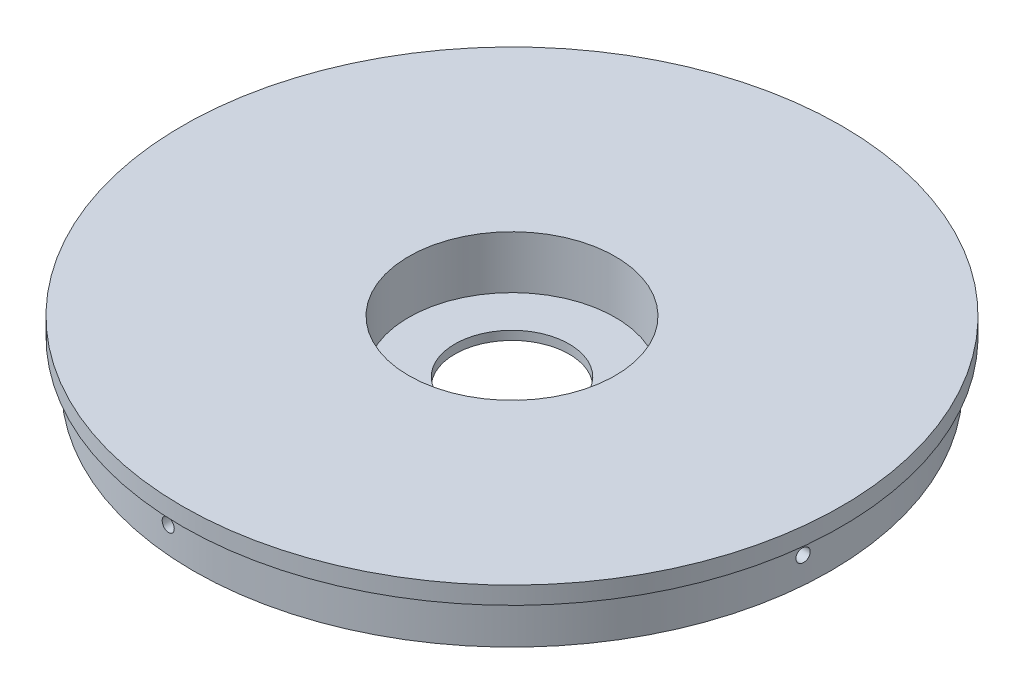
ISO-10303-21;
HEADER;
FILE_DESCRIPTION(('STEP AP214'),'2;1');
FILE_NAME('part.step','',(''),(''),'','','');
FILE_SCHEMA(('AUTOMOTIVE_DESIGN { 1 0 10303 214 1 1 1 1 }'));
ENDSEC;
DATA;
#1=APPLICATION_CONTEXT('core data for automotive mechanical design processes');
#2=APPLICATION_PROTOCOL_DEFINITION('international standard','automotive_design',2000,#1);
#3=PRODUCT_CONTEXT('',#1,'mechanical');
#4=PRODUCT('Part','Part','',(#3));
#5=PRODUCT_RELATED_PRODUCT_CATEGORY('part','',(#4));
#6=PRODUCT_DEFINITION_FORMATION('','',#4);
#7=PRODUCT_DEFINITION_CONTEXT('part definition',#1,'design');
#8=PRODUCT_DEFINITION('design','',#6,#7);
#9=PRODUCT_DEFINITION_SHAPE('','',#8);
#10=(LENGTH_UNIT() NAMED_UNIT(*) SI_UNIT(.MILLI.,.METRE.));
#11=(NAMED_UNIT(*) PLANE_ANGLE_UNIT() SI_UNIT($,.RADIAN.));
#12=(NAMED_UNIT(*) SI_UNIT($,.STERADIAN.) SOLID_ANGLE_UNIT());
#13=UNCERTAINTY_MEASURE_WITH_UNIT(LENGTH_MEASURE(1.E-05),#10,'distance_accuracy_value','');
#14=(GEOMETRIC_REPRESENTATION_CONTEXT(3) GLOBAL_UNCERTAINTY_ASSIGNED_CONTEXT((#13)) GLOBAL_UNIT_ASSIGNED_CONTEXT((#10,
#11,#12)) REPRESENTATION_CONTEXT('',''));
#15=CARTESIAN_POINT('',(0.,0.,0.));
#16=DIRECTION('',(0.,0.,1.));
#17=DIRECTION('',(1.,0.,0.));
#18=AXIS2_PLACEMENT_3D('',#15,#16,#17);
#19=CARTESIAN_POINT('',(0.,10.,0.));
#20=DIRECTION('',(0.,-1.,0.));
#21=DIRECTION('',(0.,0.,-1.));
#22=AXIS2_PLACEMENT_3D('',#19,#20,#21);
#23=CYLINDRICAL_SURFACE('',#22,72.5);
#24=CARTESIAN_POINT('',(4.50000000000025,6.,-72.3602100605022));
#25=CARTESIAN_POINT('',(4.50000374174907,5.91587615849677,-72.3602099601044));
#26=CARTESIAN_POINT('',(4.5071007640157,5.8316915099936,-72.3597695558079));
#27=CARTESIAN_POINT('',(4.53531119513864,5.66564258786703,-72.3580067745733));
#28=CARTESIAN_POINT('',(4.55644141002461,5.58378121930415,-72.356683340117));
#29=CARTESIAN_POINT('',(4.61210871373629,5.42480988251239,-72.3531562998758));
#30=CARTESIAN_POINT('',(4.64663901924744,5.34769753311128,-72.3509531394043));
#31=CARTESIAN_POINT('',(4.72810701787819,5.20039281741381,-72.345674798998));
#32=CARTESIAN_POINT('',(4.77504165429097,5.13019875213883,-72.342599833882));
#33=CARTESIAN_POINT('',(4.88001873422523,4.99863631069484,-72.3355941308026));
#34=CARTESIAN_POINT('',(4.93806970922897,4.93727477702333,-72.3316627352317));
#35=CARTESIAN_POINT('',(5.06359846691124,4.8251663026825,-72.322983348815));
#36=CARTESIAN_POINT('',(5.13107668555497,4.77441985318154,-72.3182353202015));
#37=CARTESIAN_POINT('',(5.27366744818788,4.68487970305881,-72.3079770325382));
#38=CARTESIAN_POINT('',(5.34879384343714,4.64610822081323,-72.3024653837766));
#39=CARTESIAN_POINT('',(5.50443909652356,4.58172199542251,-72.2907825040559));
#40=CARTESIAN_POINT('',(5.58495802008611,4.55610741266972,-72.2846112650571));
#41=CARTESIAN_POINT('',(5.74932872897224,4.51868730947415,-72.2717235802799));
#42=CARTESIAN_POINT('',(5.83318884277598,4.50691885985065,-72.2650057221317));
#43=CARTESIAN_POINT('',(6.00166498954412,4.49763013181845,-72.2512087133691));
#44=CARTESIAN_POINT('',(6.08628103387135,4.50011006794657,-72.2441295573163));
#45=CARTESIAN_POINT('',(6.25410078932675,4.51926243743372,-72.2297953444228));
#46=CARTESIAN_POINT('',(6.33730026700378,4.53597167320678,-72.222539878893));
#47=CARTESIAN_POINT('',(6.49970703890155,4.58315714434412,-72.2081052191229));
#48=CARTESIAN_POINT('',(6.57891428764556,4.61363353649505,-72.2009260257522));
#49=CARTESIAN_POINT('',(6.73116452183897,4.68753458302038,-72.1868913346573));
#50=CARTESIAN_POINT('',(6.80420160669461,4.73097145574073,-72.1800361494842));
#51=CARTESIAN_POINT('',(6.94194372631747,4.82956621087418,-72.1669190954641));
#52=CARTESIAN_POINT('',(7.00664881963898,4.88472401090948,-72.1606572224478));
#53=CARTESIAN_POINT('',(7.12574756396875,5.0050898144716,-72.1489937799569));
#54=CARTESIAN_POINT('',(7.18016142406479,5.07027765527196,-72.1435905277997));
#55=CARTESIAN_POINT('',(7.27725970926187,5.20894305222521,-72.1338608434414));
#56=CARTESIAN_POINT('',(7.31994442051525,5.28242040607977,-72.1295343849704));
#57=CARTESIAN_POINT('',(7.39217249046814,5.43522940652643,-72.1221679133503));
#58=CARTESIAN_POINT('',(7.42177372347057,5.51453342376913,-72.1191222376711));
#59=CARTESIAN_POINT('',(7.46724362499473,5.67702439505864,-72.1144285139073));
#60=CARTESIAN_POINT('',(7.48311268202019,5.76021123918431,-72.1127804262828));
#61=CARTESIAN_POINT('',(7.50061122555465,5.92771219936337,-72.1109624798347));
#62=CARTESIAN_POINT('',(7.50230336333962,6.0120197047441,-72.1107861171123));
#63=CARTESIAN_POINT('',(7.49156304988599,6.17971944036557,-72.111902701237));
#64=CARTESIAN_POINT('',(7.47913077817553,6.26311168222614,-72.1131956294088));
#65=CARTESIAN_POINT('',(7.44053435901963,6.42649363982922,-72.1171881051098));
#66=CARTESIAN_POINT('',(7.41438970977949,6.50648801299871,-72.1198856553088));
#67=CARTESIAN_POINT('',(7.34914049194807,6.66094542156955,-72.1265637845021));
#68=CARTESIAN_POINT('',(7.31003578766149,6.73540839904569,-72.1305443769302));
#69=CARTESIAN_POINT('',(7.21987609489738,6.87690233801308,-72.1396246139552));
#70=CARTESIAN_POINT('',(7.16879068509967,6.94391372910339,-72.1447271051741));
#71=CARTESIAN_POINT('',(7.05618525904149,7.06841876032791,-72.155827500114));
#72=CARTESIAN_POINT('',(6.99466497292109,7.12591215423793,-72.1618254269917));
#73=CARTESIAN_POINT('',(6.86261529586849,7.23003991674152,-72.1745032763913));
#74=CARTESIAN_POINT('',(6.79204440681416,7.27662128195121,-72.1811863099581));
#75=CARTESIAN_POINT('',(6.6441210488956,7.35727863715087,-72.1949525006109));
#76=CARTESIAN_POINT('',(6.56676842793461,7.39135434658228,-72.2020356666695));
#77=CARTESIAN_POINT('',(6.40714480442626,7.44616096125545,-72.2163758170897));
#78=CARTESIAN_POINT('',(6.32485574300106,7.46683913397149,-72.2236333730831));
#79=CARTESIAN_POINT('',(6.15796273897703,7.49405368973292,-72.2380544294143));
#80=CARTESIAN_POINT('',(6.07335877138498,7.50058992003166,-72.2452179287353));
#81=CARTESIAN_POINT('',(5.90413936703388,7.49932569115785,-72.259244072797));
#82=CARTESIAN_POINT('',(5.81952401757499,7.49150965678873,-72.2661063824085));
#83=CARTESIAN_POINT('',(5.65278409256646,7.46171591356295,-72.2793402654408));
#84=CARTESIAN_POINT('',(5.57065950589417,7.4397382679555,-72.2857118410532));
#85=CARTESIAN_POINT('',(5.41137678111216,7.38227340754138,-72.2978103147887));
#86=CARTESIAN_POINT('',(5.33421104738619,7.34680745900994,-72.3035382094458));
#87=CARTESIAN_POINT('',(5.18692233636441,7.26335604763094,-72.3142537538));
#88=CARTESIAN_POINT('',(5.11679898606693,7.2153712483324,-72.3192414427089));
#89=CARTESIAN_POINT('',(4.98580075035017,7.10839128159901,-72.3283906794634));
#90=CARTESIAN_POINT('',(4.92489997161533,7.04942801708805,-72.3325545507434));
#91=CARTESIAN_POINT('',(4.81384558566909,6.92205070332333,-72.3400303953193));
#92=CARTESIAN_POINT('',(4.76369450480958,6.85363443866211,-72.343342168395));
#93=CARTESIAN_POINT('',(4.67569658548248,6.7094656946478,-72.3490829817341));
#94=CARTESIAN_POINT('',(4.63782519479861,6.63372825215114,-72.3515137845846));
#95=CARTESIAN_POINT('',(4.57537348723671,6.47700954031228,-72.355490089042));
#96=CARTESIAN_POINT('',(4.55077712522707,6.39603473444501,-72.3570366595292));
#97=CARTESIAN_POINT('',(4.52213819643071,6.26211822703199,-72.3588306891907));
#98=CARTESIAN_POINT('',(4.51384687317628,6.21005036588456,-72.3593478251089));
#99=CARTESIAN_POINT('',(4.502776605769,6.10532961701939,-72.3600375420535));
#100=CARTESIAN_POINT('',(4.49999765698919,6.05267672979276,-72.3602101233693));
#101=CARTESIAN_POINT('',(4.50000000000025,6.,-72.3602100605022));
#102=B_SPLINE_CURVE_WITH_KNOTS('',3,(#24,#25,#26,#27,#28,#29,#30,#31,#32,#33,#34,#35,#36,#37,
#38,#39,#40,#41,#42,#43,#44,#45,#46,#47,#48,#49,#50,#51,#52,#53,#54,#55,#56,#57,#58,#59,#60,#61,
#62,#63,#64,#65,#66,#67,#68,#69,#70,#71,#72,#73,#74,#75,#76,#77,#78,#79,#80,#81,#82,#83,#84,#85,
#86,#87,#88,#89,#90,#91,#92,#93,#94,#95,#96,#97,#98,#99,#100,#101),.UNSPECIFIED.,.T.,.F.,(4,2,2,
2,2,2,2,2,2,2,2,2,2,2,2,2,2,2,2,2,2,2,2,2,2,2,2,2,2,2,2,2,2,2,2,2,2,2,4),(0.,0.252179134212349,
0.504660821877542,0.757014866128648,1.00930678254123,1.26179310772059,1.51429111305934,
1.76725482772181,2.02022162612619,2.27386417273426,2.52751053842806,2.78181493011235,
3.03612221800393,3.29067001279841,3.54521601862257,3.79925685625981,4.05329149559222,
4.30619089203282,4.55908313333824,4.81085718918448,5.06262804489529,5.31404186378978,
5.56545831513821,5.81752020859433,6.06958862170384,6.32285714036504,6.57613134064016,
6.83039646431679,7.0846643342888,7.33920830095009,7.59375113076411,7.8478942893648,
8.10202398010027,8.35542639209007,8.60888829258397,8.86184024659592,9.11448577651399,
9.27239562733874,9.43030534561719),.UNSPECIFIED.);
#103=CARTESIAN_POINT('',(4.50000000000025,6.,-72.3602100605022));
#104=VERTEX_POINT('',#103);
#105=EDGE_CURVE('E115',#104,#104,#102,.T.);
#106=ORIENTED_EDGE('',*,*,#105,.T.);
#107=EDGE_LOOP('',(#106));
#108=FACE_BOUND('',#107,.T.);
#109=CARTESIAN_POINT('',(-4.50000000000025,6.,72.3602100605022));
#110=CARTESIAN_POINT('',(-4.50000374174907,5.91587615849677,72.3602099601044));
#111=CARTESIAN_POINT('',(-4.5071007640157,5.8316915099936,72.3597695558079));
#112=CARTESIAN_POINT('',(-4.53531119513864,5.66564258786703,72.3580067745733));
#113=CARTESIAN_POINT('',(-4.55644141002461,5.58378121930415,72.356683340117));
#114=CARTESIAN_POINT('',(-4.61210871373629,5.42480988251239,72.3531562998758));
#115=CARTESIAN_POINT('',(-4.64663901924744,5.34769753311128,72.3509531394043));
#116=CARTESIAN_POINT('',(-4.72810701787819,5.20039281741381,72.345674798998));
#117=CARTESIAN_POINT('',(-4.77504165429097,5.13019875213883,72.342599833882));
#118=CARTESIAN_POINT('',(-4.88001873422523,4.99863631069484,72.3355941308026));
#119=CARTESIAN_POINT('',(-4.93806970922897,4.93727477702333,72.3316627352317));
#120=CARTESIAN_POINT('',(-5.06359846691124,4.8251663026825,72.322983348815));
#121=CARTESIAN_POINT('',(-5.13107668555497,4.77441985318154,72.3182353202015));
#122=CARTESIAN_POINT('',(-5.27366744818788,4.68487970305881,72.3079770325382));
#123=CARTESIAN_POINT('',(-5.34879384343714,4.64610822081323,72.3024653837766));
#124=CARTESIAN_POINT('',(-5.50443909652356,4.58172199542251,72.2907825040559));
#125=CARTESIAN_POINT('',(-5.58495802008611,4.55610741266972,72.2846112650571));
#126=CARTESIAN_POINT('',(-5.74932872897224,4.51868730947415,72.2717235802799));
#127=CARTESIAN_POINT('',(-5.83318884277598,4.50691885985065,72.2650057221317));
#128=CARTESIAN_POINT('',(-6.00166498954412,4.49763013181845,72.2512087133691));
#129=CARTESIAN_POINT('',(-6.08628103387135,4.50011006794657,72.2441295573163));
#130=CARTESIAN_POINT('',(-6.25410078932675,4.51926243743372,72.2297953444228));
#131=CARTESIAN_POINT('',(-6.33730026700378,4.53597167320678,72.222539878893));
#132=CARTESIAN_POINT('',(-6.49970703890155,4.58315714434412,72.2081052191229));
#133=CARTESIAN_POINT('',(-6.57891428764556,4.61363353649505,72.2009260257522));
#134=CARTESIAN_POINT('',(-6.73116452183897,4.68753458302038,72.1868913346573));
#135=CARTESIAN_POINT('',(-6.80420160669461,4.73097145574073,72.1800361494842));
#136=CARTESIAN_POINT('',(-6.94194372631747,4.82956621087418,72.1669190954641));
#137=CARTESIAN_POINT('',(-7.00664881963898,4.88472401090948,72.1606572224478));
#138=CARTESIAN_POINT('',(-7.12574756396875,5.0050898144716,72.1489937799569));
#139=CARTESIAN_POINT('',(-7.18016142406479,5.07027765527196,72.1435905277997));
#140=CARTESIAN_POINT('',(-7.27725970926187,5.20894305222521,72.1338608434414));
#141=CARTESIAN_POINT('',(-7.31994442051525,5.28242040607977,72.1295343849704));
#142=CARTESIAN_POINT('',(-7.39217249046814,5.43522940652643,72.1221679133503));
#143=CARTESIAN_POINT('',(-7.42177372347057,5.51453342376913,72.1191222376711));
#144=CARTESIAN_POINT('',(-7.46724362499473,5.67702439505864,72.1144285139073));
#145=CARTESIAN_POINT('',(-7.48311268202019,5.76021123918431,72.1127804262828));
#146=CARTESIAN_POINT('',(-7.50061122555465,5.92771219936337,72.1109624798347));
#147=CARTESIAN_POINT('',(-7.50230336333962,6.0120197047441,72.1107861171123));
#148=CARTESIAN_POINT('',(-7.49156304988599,6.17971944036557,72.111902701237));
#149=CARTESIAN_POINT('',(-7.47913077817553,6.26311168222614,72.1131956294088));
#150=CARTESIAN_POINT('',(-7.44053435901963,6.42649363982922,72.1171881051098));
#151=CARTESIAN_POINT('',(-7.41438970977949,6.50648801299871,72.1198856553088));
#152=CARTESIAN_POINT('',(-7.34914049194807,6.66094542156955,72.1265637845021));
#153=CARTESIAN_POINT('',(-7.31003578766149,6.73540839904569,72.1305443769302));
#154=CARTESIAN_POINT('',(-7.21987609489738,6.87690233801308,72.1396246139552));
#155=CARTESIAN_POINT('',(-7.16879068509967,6.94391372910339,72.1447271051741));
#156=CARTESIAN_POINT('',(-7.05618525904149,7.06841876032791,72.155827500114));
#157=CARTESIAN_POINT('',(-6.99466497292109,7.12591215423793,72.1618254269917));
#158=CARTESIAN_POINT('',(-6.86261529586849,7.23003991674152,72.1745032763913));
#159=CARTESIAN_POINT('',(-6.79204440681416,7.27662128195121,72.1811863099581));
#160=CARTESIAN_POINT('',(-6.6441210488956,7.35727863715087,72.1949525006109));
#161=CARTESIAN_POINT('',(-6.56676842793461,7.39135434658228,72.2020356666695));
#162=CARTESIAN_POINT('',(-6.40714480442626,7.44616096125545,72.2163758170897));
#163=CARTESIAN_POINT('',(-6.32485574300106,7.46683913397149,72.2236333730831));
#164=CARTESIAN_POINT('',(-6.15796273897703,7.49405368973292,72.2380544294143));
#165=CARTESIAN_POINT('',(-6.07335877138498,7.50058992003166,72.2452179287353));
#166=CARTESIAN_POINT('',(-5.90413936703388,7.49932569115785,72.259244072797));
#167=CARTESIAN_POINT('',(-5.81952401757499,7.49150965678873,72.2661063824085));
#168=CARTESIAN_POINT('',(-5.65278409256646,7.46171591356295,72.2793402654408));
#169=CARTESIAN_POINT('',(-5.57065950589417,7.4397382679555,72.2857118410532));
#170=CARTESIAN_POINT('',(-5.41137678111216,7.38227340754138,72.2978103147887));
#171=CARTESIAN_POINT('',(-5.33421104738619,7.34680745900994,72.3035382094458));
#172=CARTESIAN_POINT('',(-5.18692233636441,7.26335604763094,72.3142537538));
#173=CARTESIAN_POINT('',(-5.11679898606693,7.2153712483324,72.3192414427089));
#174=CARTESIAN_POINT('',(-4.98580075035017,7.10839128159901,72.3283906794634));
#175=CARTESIAN_POINT('',(-4.92489997161533,7.04942801708805,72.3325545507434));
#176=CARTESIAN_POINT('',(-4.81384558566909,6.92205070332333,72.3400303953193));
#177=CARTESIAN_POINT('',(-4.76369450480958,6.85363443866211,72.343342168395));
#178=CARTESIAN_POINT('',(-4.67569658548248,6.7094656946478,72.3490829817341));
#179=CARTESIAN_POINT('',(-4.63782519479861,6.63372825215114,72.3515137845846));
#180=CARTESIAN_POINT('',(-4.57537348723671,6.47700954031228,72.355490089042));
#181=CARTESIAN_POINT('',(-4.55077712522707,6.39603473444501,72.3570366595292));
#182=CARTESIAN_POINT('',(-4.52213819643071,6.26211822703199,72.3588306891907));
#183=CARTESIAN_POINT('',(-4.51384687317628,6.21005036588456,72.3593478251089));
#184=CARTESIAN_POINT('',(-4.502776605769,6.10532961701939,72.3600375420535));
#185=CARTESIAN_POINT('',(-4.49999765698919,6.05267672979276,72.3602101233693));
#186=CARTESIAN_POINT('',(-4.50000000000025,6.,72.3602100605022));
#187=B_SPLINE_CURVE_WITH_KNOTS('',3,(#109,#110,#111,#112,#113,#114,#115,#116,#117,#118,#119,
#120,#121,#122,#123,#124,#125,#126,#127,#128,#129,#130,#131,#132,#133,#134,#135,#136,#137,#138,
#139,#140,#141,#142,#143,#144,#145,#146,#147,#148,#149,#150,#151,#152,#153,#154,#155,#156,#157,
#158,#159,#160,#161,#162,#163,#164,#165,#166,#167,#168,#169,#170,#171,#172,#173,#174,#175,#176,
#177,#178,#179,#180,#181,#182,#183,#184,#185,#186),.UNSPECIFIED.,.T.,.F.,(4,2,2,2,2,2,2,2,2,2,2,
2,2,2,2,2,2,2,2,2,2,2,2,2,2,2,2,2,2,2,2,2,2,2,2,2,2,2,4),(0.,0.252179134212349,
0.504660821877542,0.757014866128648,1.00930678254123,1.26179310772059,1.51429111305934,
1.76725482772181,2.02022162612619,2.27386417273426,2.52751053842806,2.78181493011235,
3.03612221800393,3.29067001279841,3.54521601862257,3.79925685625981,4.05329149559222,
4.30619089203282,4.55908313333824,4.81085718918448,5.06262804489529,5.31404186378978,
5.56545831513821,5.81752020859433,6.06958862170384,6.32285714036504,6.57613134064016,
6.83039646431679,7.0846643342888,7.33920830095009,7.59375113076411,7.8478942893648,
8.10202398010027,8.35542639209007,8.60888829258397,8.86184024659592,9.11448577651399,
9.27239562733874,9.43030534561719),.UNSPECIFIED.);
#188=CARTESIAN_POINT('',(-4.50000000000025,6.,72.3602100605022));
#189=VERTEX_POINT('',#188);
#190=EDGE_CURVE('E57',#189,#189,#187,.T.);
#191=ORIENTED_EDGE('',*,*,#190,.T.);
#192=EDGE_LOOP('',(#191));
#193=FACE_BOUND('',#192,.T.);
#194=CARTESIAN_POINT('',(0.,10.,0.));
#195=DIRECTION('',(0.,-1.,0.));
#196=DIRECTION('',(0.,0.,-1.));
#197=AXIS2_PLACEMENT_3D('',#194,#195,#196);
#198=CIRCLE('',#197,72.5);
#199=CARTESIAN_POINT('',(0.,10.,-72.5));
#200=VERTEX_POINT('',#199);
#201=EDGE_CURVE('E121',#200,#200,#198,.T.);
#202=ORIENTED_EDGE('',*,*,#201,.T.);
#203=EDGE_LOOP('',(#202));
#204=FACE_BOUND('',#203,.T.);
#205=CARTESIAN_POINT('',(0.,0.,0.));
#206=DIRECTION('',(0.,-1.,0.));
#207=DIRECTION('',(0.,0.,-1.));
#208=AXIS2_PLACEMENT_3D('',#205,#206,#207);
#209=CIRCLE('',#208,72.5);
#210=CARTESIAN_POINT('',(0.,0.,-72.5));
#211=VERTEX_POINT('',#210);
#212=EDGE_CURVE('E125',#211,#211,#209,.T.);
#213=ORIENTED_EDGE('',*,*,#212,.F.);
#214=EDGE_LOOP('',(#213));
#215=FACE_BOUND('',#214,.T.);
#216=CARTESIAN_POINT('',(-72.3602100605022,6.,-4.49999999999949));
#217=CARTESIAN_POINT('',(-72.3602099601045,5.91587615849677,-4.50000374174831));
#218=CARTESIAN_POINT('',(-72.359769555808,5.8316915099936,-4.50710076401494));
#219=CARTESIAN_POINT('',(-72.3580067745733,5.66564258786703,-4.53531119513788));
#220=CARTESIAN_POINT('',(-72.356683340117,5.58378121930415,-4.55644141002385));
#221=CARTESIAN_POINT('',(-72.3531562998758,5.42480988251239,-4.61210871373553));
#222=CARTESIAN_POINT('',(-72.3509531394043,5.34769753311128,-4.64663901924668));
#223=CARTESIAN_POINT('',(-72.345674798998,5.20039281741381,-4.72810701787743));
#224=CARTESIAN_POINT('',(-72.342599833882,5.13019875213883,-4.7750416542902));
#225=CARTESIAN_POINT('',(-72.3355941308027,4.99863631069484,-4.88001873422447));
#226=CARTESIAN_POINT('',(-72.3316627352317,4.93727477702333,-4.93806970922821));
#227=CARTESIAN_POINT('',(-72.322983348815,4.8251663026825,-5.06359846691049));
#228=CARTESIAN_POINT('',(-72.3182353202015,4.77441985318154,-5.13107668555421));
#229=CARTESIAN_POINT('',(-72.3079770325382,4.68487970305882,-5.27366744818712));
#230=CARTESIAN_POINT('',(-72.3024653837766,4.64610822081323,-5.34879384343638));
#231=CARTESIAN_POINT('',(-72.290782504056,4.58172199542251,-5.5044390965228));
#232=CARTESIAN_POINT('',(-72.2846112650572,4.55610741266972,-5.58495802008535));
#233=CARTESIAN_POINT('',(-72.2717235802799,4.51868730947415,-5.74932872897148));
#234=CARTESIAN_POINT('',(-72.2650057221317,4.50691885985065,-5.83318884277522));
#235=CARTESIAN_POINT('',(-72.2512087133692,4.49763013181845,-6.00166498954336));
#236=CARTESIAN_POINT('',(-72.2441295573164,4.50011006794657,-6.08628103387059));
#237=CARTESIAN_POINT('',(-72.2297953444229,4.51926243743372,-6.25410078932599));
#238=CARTESIAN_POINT('',(-72.2225398788931,4.53597167320678,-6.33730026700302));
#239=CARTESIAN_POINT('',(-72.208105219123,4.58315714434412,-6.4997070389008));
#240=CARTESIAN_POINT('',(-72.2009260257523,4.61363353649505,-6.57891428764481));
#241=CARTESIAN_POINT('',(-72.1868913346574,4.68753458302038,-6.73116452183821));
#242=CARTESIAN_POINT('',(-72.1800361494842,4.73097145574073,-6.80420160669386));
#243=CARTESIAN_POINT('',(-72.1669190954642,4.82956621087418,-6.94194372631671));
#244=CARTESIAN_POINT('',(-72.1606572224478,4.88472401090948,-7.00664881963822));
#245=CARTESIAN_POINT('',(-72.1489937799569,5.0050898144716,-7.12574756396799));
#246=CARTESIAN_POINT('',(-72.1435905277997,5.07027765527196,-7.18016142406404));
#247=CARTESIAN_POINT('',(-72.1338608434415,5.20894305222521,-7.27725970926111));
#248=CARTESIAN_POINT('',(-72.1295343849705,5.28242040607977,-7.3199444205145));
#249=CARTESIAN_POINT('',(-72.1221679133504,5.43522940652643,-7.39217249046738));
#250=CARTESIAN_POINT('',(-72.1191222376712,5.51453342376913,-7.42177372346982));
#251=CARTESIAN_POINT('',(-72.1144285139074,5.67702439505864,-7.46724362499397));
#252=CARTESIAN_POINT('',(-72.1127804262828,5.76021123918431,-7.48311268201943));
#253=CARTESIAN_POINT('',(-72.1109624798347,5.92771219936337,-7.50061122555389));
#254=CARTESIAN_POINT('',(-72.1107861171123,6.0120197047441,-7.50230336333886));
#255=CARTESIAN_POINT('',(-72.1119027012371,6.17971944036556,-7.49156304988523));
#256=CARTESIAN_POINT('',(-72.1131956294089,6.26311168222613,-7.47913077817477));
#257=CARTESIAN_POINT('',(-72.1171881051099,6.42649363982922,-7.44053435901887));
#258=CARTESIAN_POINT('',(-72.1198856553089,6.50648801299871,-7.41438970977874));
#259=CARTESIAN_POINT('',(-72.1265637845022,6.66094542156954,-7.34914049194731));
#260=CARTESIAN_POINT('',(-72.1305443769302,6.73540839904568,-7.31003578766074));
#261=CARTESIAN_POINT('',(-72.1396246139553,6.87690233801308,-7.21987609489662));
#262=CARTESIAN_POINT('',(-72.1447271051741,6.94391372910339,-7.16879068509892));
#263=CARTESIAN_POINT('',(-72.1558275001141,7.06841876032791,-7.05618525904074));
#264=CARTESIAN_POINT('',(-72.1618254269918,7.12591215423792,-6.99466497292034));
#265=CARTESIAN_POINT('',(-72.1745032763914,7.23003991674151,-6.86261529586773));
#266=CARTESIAN_POINT('',(-72.1811863099582,7.27662128195121,-6.7920444068134));
#267=CARTESIAN_POINT('',(-72.194952500611,7.35727863715087,-6.64412104889485));
#268=CARTESIAN_POINT('',(-72.2020356666696,7.39135434658228,-6.56676842793385));
#269=CARTESIAN_POINT('',(-72.2163758170898,7.44616096125545,-6.40714480442551));
#270=CARTESIAN_POINT('',(-72.2236333730832,7.46683913397149,-6.32485574300031));
#271=CARTESIAN_POINT('',(-72.2380544294143,7.49405368973292,-6.15796273897628));
#272=CARTESIAN_POINT('',(-72.2452179287354,7.50058992003166,-6.07335877138423));
#273=CARTESIAN_POINT('',(-72.2592440727971,7.49932569115785,-5.90413936703312));
#274=CARTESIAN_POINT('',(-72.2661063824086,7.49150965678873,-5.81952401757424));
#275=CARTESIAN_POINT('',(-72.2793402654409,7.46171591356295,-5.6527840925657));
#276=CARTESIAN_POINT('',(-72.2857118410533,7.4397382679555,-5.57065950589342));
#277=CARTESIAN_POINT('',(-72.2978103147888,7.38227340754138,-5.4113767811114));
#278=CARTESIAN_POINT('',(-72.3035382094459,7.34680745900994,-5.33421104738543));
#279=CARTESIAN_POINT('',(-72.3142537538,7.26335604763094,-5.18692233636365));
#280=CARTESIAN_POINT('',(-72.319241442709,7.2153712483324,-5.11679898606618));
#281=CARTESIAN_POINT('',(-72.3283906794635,7.10839128159901,-4.98580075034942));
#282=CARTESIAN_POINT('',(-72.3325545507434,7.04942801708805,-4.92489997161458));
#283=CARTESIAN_POINT('',(-72.3400303953193,6.92205070332334,-4.81384558566833));
#284=CARTESIAN_POINT('',(-72.3433421683951,6.85363443866211,-4.76369450480883));
#285=CARTESIAN_POINT('',(-72.3490829817341,6.7094656946478,-4.67569658548172));
#286=CARTESIAN_POINT('',(-72.3515137845846,6.63372825215114,-4.63782519479785));
#287=CARTESIAN_POINT('',(-72.3554900890421,6.47700954031228,-4.57537348723595));
#288=CARTESIAN_POINT('',(-72.3570366595292,6.39603473444501,-4.55077712522631));
#289=CARTESIAN_POINT('',(-72.3588306891908,6.26211822703199,-4.52213819642996));
#290=CARTESIAN_POINT('',(-72.3593478251089,6.21005036588456,-4.51384687317552));
#291=CARTESIAN_POINT('',(-72.3600375420536,6.10532961701939,-4.50277660576824));
#292=CARTESIAN_POINT('',(-72.3602101233694,6.05267672979276,-4.49999765698843));
#293=CARTESIAN_POINT('',(-72.3602100605022,6.,-4.49999999999949));
#294=B_SPLINE_CURVE_WITH_KNOTS('',3,(#216,#217,#218,#219,#220,#221,#222,#223,#224,#225,#226,
#227,#228,#229,#230,#231,#232,#233,#234,#235,#236,#237,#238,#239,#240,#241,#242,#243,#244,#245,
#246,#247,#248,#249,#250,#251,#252,#253,#254,#255,#256,#257,#258,#259,#260,#261,#262,#263,#264,
#265,#266,#267,#268,#269,#270,#271,#272,#273,#274,#275,#276,#277,#278,#279,#280,#281,#282,#283,
#284,#285,#286,#287,#288,#289,#290,#291,#292,#293),.UNSPECIFIED.,.T.,.F.,(4,2,2,2,2,2,2,2,2,2,2,
2,2,2,2,2,2,2,2,2,2,2,2,2,2,2,2,2,2,2,2,2,2,2,2,2,2,2,4),(0.,0.252179134212349,
0.504660821877541,0.757014866128646,1.00930678254123,1.26179310772059,1.51429111305934,
1.76725482772181,2.02022162612619,2.27386417273425,2.52751053842806,2.78181493011235,
3.03612221800392,3.29067001279841,3.54521601862257,3.79925685625981,4.05329149559222,
4.30619089203281,4.55908313333824,4.81085718918448,5.06262804489529,5.31404186378978,
5.56545831513821,5.81752020859433,6.06958862170384,6.32285714036504,6.57613134064016,
6.83039646431678,7.0846643342888,7.33920830095009,7.59375113076411,7.84789428936479,
8.10202398010027,8.35542639209007,8.60888829258397,8.86184024659592,9.11448577651399,
9.27239562733874,9.43030534561719),.UNSPECIFIED.);
#295=CARTESIAN_POINT('',(-72.3602100605022,6.,-4.49999999999949));
#296=VERTEX_POINT('',#295);
#297=EDGE_CURVE('E66',#296,#296,#294,.T.);
#298=ORIENTED_EDGE('',*,*,#297,.T.);
#299=EDGE_LOOP('',(#298));
#300=FACE_BOUND('',#299,.T.);
#301=CARTESIAN_POINT('',(72.3602100605022,6.,4.5));
#302=CARTESIAN_POINT('',(72.3602099601045,5.91587615849677,4.50000374174882));
#303=CARTESIAN_POINT('',(72.3597695558079,5.8316915099936,4.50710076401545));
#304=CARTESIAN_POINT('',(72.3580067745733,5.66564258786703,4.53531119513839));
#305=CARTESIAN_POINT('',(72.356683340117,5.58378121930415,4.55644141002435));
#306=CARTESIAN_POINT('',(72.3531562998758,5.42480988251239,4.61210871373604));
#307=CARTESIAN_POINT('',(72.3509531394043,5.34769753311128,4.64663901924718));
#308=CARTESIAN_POINT('',(72.345674798998,5.20039281741381,4.72810701787794));
#309=CARTESIAN_POINT('',(72.342599833882,5.13019875213883,4.77504165429071));
#310=CARTESIAN_POINT('',(72.3355941308027,4.99863631069484,4.88001873422498));
#311=CARTESIAN_POINT('',(72.3316627352317,4.93727477702334,4.93806970922872));
#312=CARTESIAN_POINT('',(72.322983348815,4.8251663026825,5.06359846691099));
#313=CARTESIAN_POINT('',(72.3182353202015,4.77441985318154,5.13107668555472));
#314=CARTESIAN_POINT('',(72.3079770325382,4.68487970305882,5.27366744818763));
#315=CARTESIAN_POINT('',(72.3024653837766,4.64610822081323,5.34879384343689));
#316=CARTESIAN_POINT('',(72.290782504056,4.58172199542251,5.5044390965233));
#317=CARTESIAN_POINT('',(72.2846112650571,4.55610741266972,5.58495802008586));
#318=CARTESIAN_POINT('',(72.2717235802799,4.51868730947415,5.74932872897198));
#319=CARTESIAN_POINT('',(72.2650057221317,4.50691885985065,5.83318884277573));
#320=CARTESIAN_POINT('',(72.2512087133692,4.49763013181845,6.00166498954386));
#321=CARTESIAN_POINT('',(72.2441295573164,4.50011006794657,6.08628103387109));
#322=CARTESIAN_POINT('',(72.2297953444229,4.51926243743372,6.2541007893265));
#323=CARTESIAN_POINT('',(72.222539878893,4.53597167320678,6.33730026700352));
#324=CARTESIAN_POINT('',(72.2081052191229,4.58315714434412,6.4997070389013));
#325=CARTESIAN_POINT('',(72.2009260257522,4.61363353649505,6.57891428764531));
#326=CARTESIAN_POINT('',(72.1868913346574,4.68753458302038,6.73116452183871));
#327=CARTESIAN_POINT('',(72.1800361494842,4.73097145574073,6.80420160669436));
#328=CARTESIAN_POINT('',(72.1669190954642,4.82956621087418,6.94194372631721));
#329=CARTESIAN_POINT('',(72.1606572224478,4.88472401090948,7.00664881963873));
#330=CARTESIAN_POINT('',(72.1489937799569,5.0050898144716,7.1257475639685));
#331=CARTESIAN_POINT('',(72.1435905277997,5.07027765527196,7.18016142406454));
#332=CARTESIAN_POINT('',(72.1338608434415,5.20894305222521,7.27725970926161));
#333=CARTESIAN_POINT('',(72.1295343849704,5.28242040607977,7.319944420515));
#334=CARTESIAN_POINT('',(72.1221679133503,5.43522940652643,7.39217249046789));
#335=CARTESIAN_POINT('',(72.1191222376712,5.51453342376913,7.42177372347032));
#336=CARTESIAN_POINT('',(72.1144285139073,5.67702439505864,7.46724362499447));
#337=CARTESIAN_POINT('',(72.1127804262828,5.76021123918431,7.48311268201994));
#338=CARTESIAN_POINT('',(72.1109624798347,5.92771219936337,7.5006112255544));
#339=CARTESIAN_POINT('',(72.1107861171123,6.0120197047441,7.50230336333937));
#340=CARTESIAN_POINT('',(72.1119027012371,6.17971944036556,7.49156304988574));
#341=CARTESIAN_POINT('',(72.1131956294088,6.26311168222613,7.47913077817528));
#342=CARTESIAN_POINT('',(72.1171881051098,6.42649363982922,7.44053435901937));
#343=CARTESIAN_POINT('',(72.1198856553089,6.50648801299871,7.41438970977924));
#344=CARTESIAN_POINT('',(72.1265637845022,6.66094542156955,7.34914049194782));
#345=CARTESIAN_POINT('',(72.1305443769302,6.73540839904569,7.31003578766124));
#346=CARTESIAN_POINT('',(72.1396246139552,6.87690233801308,7.21987609489713));
#347=CARTESIAN_POINT('',(72.1447271051741,6.94391372910339,7.16879068509942));
#348=CARTESIAN_POINT('',(72.155827500114,7.06841876032791,7.05618525904124));
#349=CARTESIAN_POINT('',(72.1618254269917,7.12591215423792,6.99466497292084));
#350=CARTESIAN_POINT('',(72.1745032763913,7.23003991674151,6.86261529586823));
#351=CARTESIAN_POINT('',(72.1811863099582,7.27662128195121,6.79204440681391));
#352=CARTESIAN_POINT('',(72.194952500611,7.35727863715087,6.64412104889535));
#353=CARTESIAN_POINT('',(72.2020356666696,7.39135434658228,6.56676842793436));
#354=CARTESIAN_POINT('',(72.2163758170897,7.44616096125545,6.40714480442601));
#355=CARTESIAN_POINT('',(72.2236333730831,7.46683913397149,6.32485574300081));
#356=CARTESIAN_POINT('',(72.2380544294143,7.49405368973292,6.15796273897678));
#357=CARTESIAN_POINT('',(72.2452179287354,7.50058992003166,6.07335877138473));
#358=CARTESIAN_POINT('',(72.259244072797,7.49932569115785,5.90413936703362));
#359=CARTESIAN_POINT('',(72.2661063824086,7.49150965678873,5.81952401757474));
#360=CARTESIAN_POINT('',(72.2793402654409,7.46171591356295,5.65278409256621));
#361=CARTESIAN_POINT('',(72.2857118410533,7.4397382679555,5.57065950589392));
#362=CARTESIAN_POINT('',(72.2978103147887,7.38227340754138,5.41137678111191));
#363=CARTESIAN_POINT('',(72.3035382094458,7.34680745900994,5.33421104738594));
#364=CARTESIAN_POINT('',(72.3142537538,7.26335604763094,5.18692233636416));
#365=CARTESIAN_POINT('',(72.3192414427089,7.2153712483324,5.11679898606668));
#366=CARTESIAN_POINT('',(72.3283906794634,7.10839128159901,4.98580075034992));
#367=CARTESIAN_POINT('',(72.3325545507434,7.04942801708805,4.92489997161508));
#368=CARTESIAN_POINT('',(72.3400303953193,6.92205070332334,4.81384558566884));
#369=CARTESIAN_POINT('',(72.3433421683951,6.85363443866211,4.76369450480933));
#370=CARTESIAN_POINT('',(72.3490829817341,6.7094656946478,4.67569658548223));
#371=CARTESIAN_POINT('',(72.3515137845846,6.63372825215114,4.63782519479836));
#372=CARTESIAN_POINT('',(72.355490089042,6.47700954031228,4.57537348723646));
#373=CARTESIAN_POINT('',(72.3570366595292,6.39603473444501,4.55077712522681));
#374=CARTESIAN_POINT('',(72.3588306891908,6.26211822703199,4.52213819643046));
#375=CARTESIAN_POINT('',(72.3593478251089,6.21005036588456,4.51384687317603));
#376=CARTESIAN_POINT('',(72.3600375420536,6.10532961701939,4.50277660576875));
#377=CARTESIAN_POINT('',(72.3602101233693,6.05267672979276,4.49999765698893));
#378=CARTESIAN_POINT('',(72.3602100605022,6.,4.5));
#379=B_SPLINE_CURVE_WITH_KNOTS('',3,(#301,#302,#303,#304,#305,#306,#307,#308,#309,#310,#311,
#312,#313,#314,#315,#316,#317,#318,#319,#320,#321,#322,#323,#324,#325,#326,#327,#328,#329,#330,
#331,#332,#333,#334,#335,#336,#337,#338,#339,#340,#341,#342,#343,#344,#345,#346,#347,#348,#349,
#350,#351,#352,#353,#354,#355,#356,#357,#358,#359,#360,#361,#362,#363,#364,#365,#366,#367,#368,
#369,#370,#371,#372,#373,#374,#375,#376,#377,#378),.UNSPECIFIED.,.T.,.F.,(4,2,2,2,2,2,2,2,2,2,2,
2,2,2,2,2,2,2,2,2,2,2,2,2,2,2,2,2,2,2,2,2,2,2,2,2,2,2,4),(0.,0.252179134212349,
0.504660821877541,0.757014866128646,1.00930678254123,1.26179310772059,1.51429111305934,
1.76725482772181,2.02022162612619,2.27386417273425,2.52751053842806,2.78181493011235,
3.03612221800393,3.29067001279841,3.54521601862257,3.79925685625981,4.05329149559222,
4.30619089203281,4.55908313333824,4.81085718918448,5.06262804489529,5.31404186378978,
5.56545831513821,5.81752020859433,6.06958862170384,6.32285714036504,6.57613134064016,
6.83039646431678,7.0846643342888,7.33920830095009,7.59375113076411,7.84789428936479,
8.10202398010027,8.35542639209006,8.60888829258397,8.86184024659592,9.11448577651398,
9.27239562733874,9.43030534561719),.UNSPECIFIED.);
#380=CARTESIAN_POINT('',(72.3602100605022,6.,4.5));
#381=VERTEX_POINT('',#380);
#382=EDGE_CURVE('E35',#381,#381,#379,.T.);
#383=ORIENTED_EDGE('',*,*,#382,.T.);
#384=EDGE_LOOP('',(#383));
#385=FACE_BOUND('',#384,.T.);
#386=ADVANCED_FACE('F31',(#108,#193,#204,#215,#300,#385),#23,.T.);
#387=CARTESIAN_POINT('',(0.,14.,0.));
#388=DIRECTION('',(0.,-1.,0.));
#389=DIRECTION('',(0.,0.,-1.));
#390=AXIS2_PLACEMENT_3D('',#387,#388,#389);
#391=CYLINDRICAL_SURFACE('',#390,75.);
#392=CARTESIAN_POINT('',(0.,14.,0.));
#393=DIRECTION('',(0.,1.,0.));
#394=DIRECTION('',(0.,0.,1.));
#395=AXIS2_PLACEMENT_3D('',#392,#393,#394);
#396=CIRCLE('',#395,75.);
#397=CARTESIAN_POINT('',(0.,14.,75.));
#398=VERTEX_POINT('',#397);
#399=EDGE_CURVE('E10',#398,#398,#396,.T.);
#400=ORIENTED_EDGE('',*,*,#399,.F.);
#401=EDGE_LOOP('',(#400));
#402=FACE_BOUND('',#401,.T.);
#403=CARTESIAN_POINT('',(0.,10.,0.));
#404=DIRECTION('',(0.,-1.,0.));
#405=DIRECTION('',(0.,0.,-1.));
#406=AXIS2_PLACEMENT_3D('',#403,#404,#405);
#407=CIRCLE('',#406,75.);
#408=CARTESIAN_POINT('',(0.,10.,-75.));
#409=VERTEX_POINT('',#408);
#410=EDGE_CURVE('E178',#409,#409,#407,.T.);
#411=ORIENTED_EDGE('',*,*,#410,.F.);
#412=EDGE_LOOP('',(#411));
#413=FACE_BOUND('',#412,.T.);
#414=ADVANCED_FACE('F33',(#402,#413),#391,.T.);
#415=CARTESIAN_POINT('',(0.,0.,0.));
#416=DIRECTION('',(0.,1.,0.));
#417=DIRECTION('',(0.,0.,1.));
#418=AXIS2_PLACEMENT_3D('',#415,#416,#417);
#419=PLANE('',#418);
#420=CARTESIAN_POINT('',(-23.0602709044661,0.,19.5003565560361));
#421=DIRECTION('',(0.,-1.,0.));
#422=DIRECTION('',(0.,0.,-1.));
#423=AXIS2_PLACEMENT_3D('',#420,#421,#422);
#424=CIRCLE('',#423,1.5);
#425=CARTESIAN_POINT('',(-23.0602709044661,0.,18.0003565560361));
#426=VERTEX_POINT('',#425);
#427=EDGE_CURVE('E169',#426,#426,#424,.T.);
#428=ORIENTED_EDGE('',*,*,#427,.F.);
#429=EDGE_LOOP('',(#428));
#430=FACE_BOUND('',#429,.T.);
#431=CARTESIAN_POINT('',(28.8635178870499,0.,-24.4077310535836));
#432=DIRECTION('',(0.,-1.,0.));
#433=DIRECTION('',(0.,0.,-1.));
#434=AXIS2_PLACEMENT_3D('',#431,#432,#433);
#435=CIRCLE('',#434,1.5);
#436=CARTESIAN_POINT('',(28.8635178870499,0.,-25.9077310535836));
#437=VERTEX_POINT('',#436);
#438=EDGE_CURVE('E64',#437,#437,#435,.T.);
#439=ORIENTED_EDGE('',*,*,#438,.F.);
#440=EDGE_LOOP('',(#439));
#441=FACE_BOUND('',#440,.T.);
#442=CARTESIAN_POINT('',(0.,0.,0.));
#443=DIRECTION('',(0.,1.,0.));
#444=DIRECTION('',(0.,0.,1.));
#445=AXIS2_PLACEMENT_3D('',#442,#443,#444);
#446=CIRCLE('',#445,13.);
#447=CARTESIAN_POINT('',(0.,0.,13.));
#448=VERTEX_POINT('',#447);
#449=EDGE_CURVE('E53',#448,#448,#446,.T.);
#450=ORIENTED_EDGE('',*,*,#449,.T.);
#451=EDGE_LOOP('',(#450));
#452=FACE_BOUND('',#451,.T.);
#453=ORIENTED_EDGE('',*,*,#212,.T.);
#454=EDGE_LOOP('',(#453));
#455=FACE_BOUND('',#454,.T.);
#456=ADVANCED_FACE('F110',(#430,#441,#452,#455),#419,.F.);
#457=CARTESIAN_POINT('',(0.,14.,0.));
#458=DIRECTION('',(0.,1.,0.));
#459=DIRECTION('',(0.,0.,1.));
#460=AXIS2_PLACEMENT_3D('',#457,#458,#459);
#461=PLANE('',#460);
#462=CARTESIAN_POINT('',(0.,14.,0.));
#463=DIRECTION('',(0.,1.,0.));
#464=DIRECTION('',(0.,0.,1.));
#465=AXIS2_PLACEMENT_3D('',#462,#463,#464);
#466=CIRCLE('',#465,23.5);
#467=CARTESIAN_POINT('',(0.,14.,23.5));
#468=VERTEX_POINT('',#467);
#469=EDGE_CURVE('E49',#468,#468,#466,.T.);
#470=ORIENTED_EDGE('',*,*,#469,.F.);
#471=EDGE_LOOP('',(#470));
#472=FACE_BOUND('',#471,.T.);
#473=ORIENTED_EDGE('',*,*,#399,.T.);
#474=EDGE_LOOP('',(#473));
#475=FACE_BOUND('',#474,.T.);
#476=ADVANCED_FACE('F196',(#472,#475),#461,.T.);
#477=CARTESIAN_POINT('',(0.,2.,0.));
#478=DIRECTION('',(0.,1.,0.));
#479=DIRECTION('',(0.,0.,1.));
#480=AXIS2_PLACEMENT_3D('',#477,#478,#479);
#481=CYLINDRICAL_SURFACE('',#480,23.5);
#482=CARTESIAN_POINT('',(0.,2.,0.));
#483=DIRECTION('',(0.,1.,0.));
#484=DIRECTION('',(0.,0.,1.));
#485=AXIS2_PLACEMENT_3D('',#482,#483,#484);
#486=CIRCLE('',#485,23.5);
#487=CARTESIAN_POINT('',(0.,2.,23.5));
#488=VERTEX_POINT('',#487);
#489=EDGE_CURVE('E44',#488,#488,#486,.T.);
#490=ORIENTED_EDGE('',*,*,#489,.F.);
#491=EDGE_LOOP('',(#490));
#492=FACE_BOUND('',#491,.T.);
#493=ORIENTED_EDGE('',*,*,#469,.T.);
#494=EDGE_LOOP('',(#493));
#495=FACE_BOUND('',#494,.T.);
#496=ADVANCED_FACE('F190',(#492,#495),#481,.F.);
#497=CARTESIAN_POINT('',(0.,2.,0.));
#498=DIRECTION('',(0.,1.,0.));
#499=DIRECTION('',(0.,0.,1.));
#500=AXIS2_PLACEMENT_3D('',#497,#498,#499);
#501=PLANE('',#500);
#502=CARTESIAN_POINT('',(0.,2.,0.));
#503=DIRECTION('',(0.,1.,0.));
#504=DIRECTION('',(0.,0.,1.));
#505=AXIS2_PLACEMENT_3D('',#502,#503,#504);
#506=CIRCLE('',#505,13.);
#507=CARTESIAN_POINT('',(0.,2.,13.));
#508=VERTEX_POINT('',#507);
#509=EDGE_CURVE('E56',#508,#508,#506,.T.);
#510=ORIENTED_EDGE('',*,*,#509,.F.);
#511=EDGE_LOOP('',(#510));
#512=FACE_BOUND('',#511,.T.);
#513=ORIENTED_EDGE('',*,*,#489,.T.);
#514=EDGE_LOOP('',(#513));
#515=FACE_BOUND('',#514,.T.);
#516=ADVANCED_FACE('F187',(#512,#515),#501,.T.);
#517=CARTESIAN_POINT('',(0.,-10.,0.));
#518=DIRECTION('',(0.,1.,0.));
#519=DIRECTION('',(0.,0.,1.));
#520=AXIS2_PLACEMENT_3D('',#517,#518,#519);
#521=CYLINDRICAL_SURFACE('',#520,13.);
#522=ORIENTED_EDGE('',*,*,#509,.T.);
#523=EDGE_LOOP('',(#522));
#524=FACE_BOUND('',#523,.T.);
#525=ORIENTED_EDGE('',*,*,#449,.F.);
#526=EDGE_LOOP('',(#525));
#527=FACE_BOUND('',#526,.T.);
#528=ADVANCED_FACE('F100',(#524,#527),#521,.F.);
#529=CARTESIAN_POINT('',(0.,10.,0.));
#530=DIRECTION('',(0.,-1.,0.));
#531=DIRECTION('',(0.,0.,-1.));
#532=AXIS2_PLACEMENT_3D('',#529,#530,#531);
#533=PLANE('',#532);
#534=ORIENTED_EDGE('',*,*,#201,.F.);
#535=EDGE_LOOP('',(#534));
#536=FACE_BOUND('',#535,.T.);
#537=ORIENTED_EDGE('',*,*,#410,.T.);
#538=EDGE_LOOP('',(#537));
#539=FACE_BOUND('',#538,.T.);
#540=ADVANCED_FACE('F94',(#536,#539),#533,.T.);
#541=CARTESIAN_POINT('',(28.8635178870499,6.,-24.4077310535836));
#542=DIRECTION('',(0.,-1.,0.));
#543=DIRECTION('',(0.,0.,-1.));
#544=AXIS2_PLACEMENT_3D('',#541,#542,#543);
#545=CYLINDRICAL_SURFACE('',#544,1.5);
#546=CARTESIAN_POINT('',(28.8635178870499,6.,-24.4077310535836));
#547=DIRECTION('',(0.,-1.,0.));
#548=DIRECTION('',(0.,0.,-1.));
#549=AXIS2_PLACEMENT_3D('',#546,#547,#548);
#550=CIRCLE('',#549,1.5);
#551=CARTESIAN_POINT('',(28.8635178870499,6.,-25.9077310535836));
#552=VERTEX_POINT('',#551);
#553=EDGE_CURVE('E172',#552,#552,#550,.T.);
#554=ORIENTED_EDGE('',*,*,#553,.F.);
#555=EDGE_LOOP('',(#554));
#556=FACE_BOUND('',#555,.T.);
#557=ORIENTED_EDGE('',*,*,#438,.T.);
#558=EDGE_LOOP('',(#557));
#559=FACE_BOUND('',#558,.T.);
#560=ADVANCED_FACE('F91',(#556,#559),#545,.F.);
#561=CARTESIAN_POINT('',(28.8635178870499,6.,-24.4077310535836));
#562=DIRECTION('',(0.,-1.,0.));
#563=DIRECTION('',(0.,0.,-1.));
#564=AXIS2_PLACEMENT_3D('',#561,#562,#563);
#565=PLANE('',#564);
#566=ORIENTED_EDGE('',*,*,#553,.T.);
#567=EDGE_LOOP('',(#566));
#568=FACE_BOUND('',#567,.T.);
#569=ADVANCED_FACE('F88',(#568),#565,.T.);
#570=CARTESIAN_POINT('',(-23.0602709044661,6.,19.5003565560361));
#571=DIRECTION('',(0.,-1.,0.));
#572=DIRECTION('',(0.,0.,-1.));
#573=AXIS2_PLACEMENT_3D('',#570,#571,#572);
#574=CYLINDRICAL_SURFACE('',#573,1.5);
#575=CARTESIAN_POINT('',(-23.0602709044661,6.,19.5003565560361));
#576=DIRECTION('',(0.,-1.,0.));
#577=DIRECTION('',(0.,0.,-1.));
#578=AXIS2_PLACEMENT_3D('',#575,#576,#577);
#579=CIRCLE('',#578,1.5);
#580=CARTESIAN_POINT('',(-23.0602709044661,6.,18.0003565560361));
#581=VERTEX_POINT('',#580);
#582=EDGE_CURVE('E166',#581,#581,#579,.T.);
#583=ORIENTED_EDGE('',*,*,#582,.F.);
#584=EDGE_LOOP('',(#583));
#585=FACE_BOUND('',#584,.T.);
#586=ORIENTED_EDGE('',*,*,#427,.T.);
#587=EDGE_LOOP('',(#586));
#588=FACE_BOUND('',#587,.T.);
#589=ADVANCED_FACE('F84',(#585,#588),#574,.F.);
#590=CARTESIAN_POINT('',(-23.0602709044661,6.,19.5003565560361));
#591=DIRECTION('',(0.,-1.,0.));
#592=DIRECTION('',(0.,0.,-1.));
#593=AXIS2_PLACEMENT_3D('',#590,#591,#592);
#594=PLANE('',#593);
#595=ORIENTED_EDGE('',*,*,#582,.T.);
#596=EDGE_LOOP('',(#595));
#597=FACE_BOUND('',#596,.T.);
#598=ADVANCED_FACE('F80',(#597),#594,.T.);
#599=CARTESIAN_POINT('',(-6.00000000000023,6.,66.5));
#600=DIRECTION('',(0.,0.,1.));
#601=DIRECTION('',(1.,0.,0.));
#602=AXIS2_PLACEMENT_3D('',#599,#600,#601);
#603=CYLINDRICAL_SURFACE('',#602,1.5);
#604=ORIENTED_EDGE('',*,*,#190,.F.);
#605=EDGE_LOOP('',(#604));
#606=FACE_BOUND('',#605,.T.);
#607=CARTESIAN_POINT('',(-6.00000000000023,6.,66.5));
#608=DIRECTION('',(0.,0.,-1.));
#609=DIRECTION('',(-1.,0.,0.));
#610=AXIS2_PLACEMENT_3D('',#607,#608,#609);
#611=CIRCLE('',#610,1.5);
#612=CARTESIAN_POINT('',(-7.50000000000023,6.,66.5));
#613=VERTEX_POINT('',#612);
#614=EDGE_CURVE('E65',#613,#613,#611,.T.);
#615=ORIENTED_EDGE('',*,*,#614,.T.);
#616=EDGE_LOOP('',(#615));
#617=FACE_BOUND('',#616,.T.);
#618=ADVANCED_FACE('F74',(#606,#617),#603,.F.);
#619=CARTESIAN_POINT('',(-6.00000000000023,6.,66.5));
#620=DIRECTION('',(0.,0.,-1.));
#621=DIRECTION('',(-1.,0.,0.));
#622=AXIS2_PLACEMENT_3D('',#619,#620,#621);
#623=PLANE('',#622);
#624=ORIENTED_EDGE('',*,*,#614,.F.);
#625=EDGE_LOOP('',(#624));
#626=FACE_BOUND('',#625,.T.);
#627=ADVANCED_FACE('F79',(#626),#623,.F.);
#628=CARTESIAN_POINT('',(-66.5000000000001,6.,-5.99999999999954));
#629=DIRECTION('',(-1.,0.,0.));
#630=DIRECTION('',(0.,0.,1.));
#631=AXIS2_PLACEMENT_3D('',#628,#629,#630);
#632=CYLINDRICAL_SURFACE('',#631,1.5);
#633=ORIENTED_EDGE('',*,*,#297,.F.);
#634=EDGE_LOOP('',(#633));
#635=FACE_BOUND('',#634,.T.);
#636=CARTESIAN_POINT('',(-66.5000000000001,6.,-5.99999999999954));
#637=DIRECTION('',(1.,0.,0.));
#638=DIRECTION('',(0.,0.,-1.));
#639=AXIS2_PLACEMENT_3D('',#636,#637,#638);
#640=CIRCLE('',#639,1.5);
#641=CARTESIAN_POINT('',(-66.5000000000001,6.,-7.49999999999954));
#642=VERTEX_POINT('',#641);
#643=EDGE_CURVE('E159',#642,#642,#640,.T.);
#644=ORIENTED_EDGE('',*,*,#643,.T.);
#645=EDGE_LOOP('',(#644));
#646=FACE_BOUND('',#645,.T.);
#647=ADVANCED_FACE('F148',(#635,#646),#632,.F.);
#648=CARTESIAN_POINT('',(-66.5000000000001,6.,-5.99999999999954));
#649=DIRECTION('',(1.,0.,0.));
#650=DIRECTION('',(0.,0.,-1.));
#651=AXIS2_PLACEMENT_3D('',#648,#649,#650);
#652=PLANE('',#651);
#653=ORIENTED_EDGE('',*,*,#643,.F.);
#654=EDGE_LOOP('',(#653));
#655=FACE_BOUND('',#654,.T.);
#656=ADVANCED_FACE('F145',(#655),#652,.F.);
#657=CARTESIAN_POINT('',(6.00000000000023,6.,-66.5));
#658=DIRECTION('',(0.,0.,-1.));
#659=DIRECTION('',(-1.,0.,0.));
#660=AXIS2_PLACEMENT_3D('',#657,#658,#659);
#661=CYLINDRICAL_SURFACE('',#660,1.5);
#662=ORIENTED_EDGE('',*,*,#105,.F.);
#663=EDGE_LOOP('',(#662));
#664=FACE_BOUND('',#663,.T.);
#665=CARTESIAN_POINT('',(6.00000000000023,6.,-66.5));
#666=DIRECTION('',(0.,0.,1.));
#667=DIRECTION('',(1.,0.,0.));
#668=AXIS2_PLACEMENT_3D('',#665,#666,#667);
#669=CIRCLE('',#668,1.5);
#670=CARTESIAN_POINT('',(7.50000000000023,6.,-66.5));
#671=VERTEX_POINT('',#670);
#672=EDGE_CURVE('E160',#671,#671,#669,.T.);
#673=ORIENTED_EDGE('',*,*,#672,.T.);
#674=EDGE_LOOP('',(#673));
#675=FACE_BOUND('',#674,.T.);
#676=ADVANCED_FACE('F139',(#664,#675),#661,.F.);
#677=CARTESIAN_POINT('',(6.00000000000023,6.,-66.5));
#678=DIRECTION('',(0.,0.,1.));
#679=DIRECTION('',(1.,0.,0.));
#680=AXIS2_PLACEMENT_3D('',#677,#678,#679);
#681=PLANE('',#680);
#682=ORIENTED_EDGE('',*,*,#672,.F.);
#683=EDGE_LOOP('',(#682));
#684=FACE_BOUND('',#683,.T.);
#685=ADVANCED_FACE('F144',(#684),#681,.F.);
#686=CARTESIAN_POINT('',(66.5,6.,6.));
#687=DIRECTION('',(1.,0.,0.));
#688=DIRECTION('',(0.,0.,-1.));
#689=AXIS2_PLACEMENT_3D('',#686,#687,#688);
#690=CYLINDRICAL_SURFACE('',#689,1.5);
#691=ORIENTED_EDGE('',*,*,#382,.F.);
#692=EDGE_LOOP('',(#691));
#693=FACE_BOUND('',#692,.T.);
#694=CARTESIAN_POINT('',(66.5,6.,6.));
#695=DIRECTION('',(-1.,0.,0.));
#696=DIRECTION('',(0.,0.,1.));
#697=AXIS2_PLACEMENT_3D('',#694,#695,#696);
#698=CIRCLE('',#697,1.5);
#699=CARTESIAN_POINT('',(66.5,6.,7.5));
#700=VERTEX_POINT('',#699);
#701=EDGE_CURVE('E134',#700,#700,#698,.T.);
#702=ORIENTED_EDGE('',*,*,#701,.T.);
#703=EDGE_LOOP('',(#702));
#704=FACE_BOUND('',#703,.T.);
#705=ADVANCED_FACE('F249',(#693,#704),#690,.F.);
#706=CARTESIAN_POINT('',(66.5,6.,6.));
#707=DIRECTION('',(-1.,0.,0.));
#708=DIRECTION('',(0.,0.,1.));
#709=AXIS2_PLACEMENT_3D('',#706,#707,#708);
#710=PLANE('',#709);
#711=ORIENTED_EDGE('',*,*,#701,.F.);
#712=EDGE_LOOP('',(#711));
#713=FACE_BOUND('',#712,.T.);
#714=ADVANCED_FACE('F257',(#713),#710,.F.);
#715=CLOSED_SHELL('',(#386,#414,#456,#476,#496,#516,#528,#540,#560,#569,#589,#598,#618,#627,
#647,#656,#676,#685,#705,#714));
#716=MANIFOLD_SOLID_BREP('B2',#715);
#717=ADVANCED_BREP_SHAPE_REPRESENTATION('',(#18,#716),#14);
#718=SHAPE_DEFINITION_REPRESENTATION(#9,#717);
ENDSEC;
END-ISO-10303-21;
